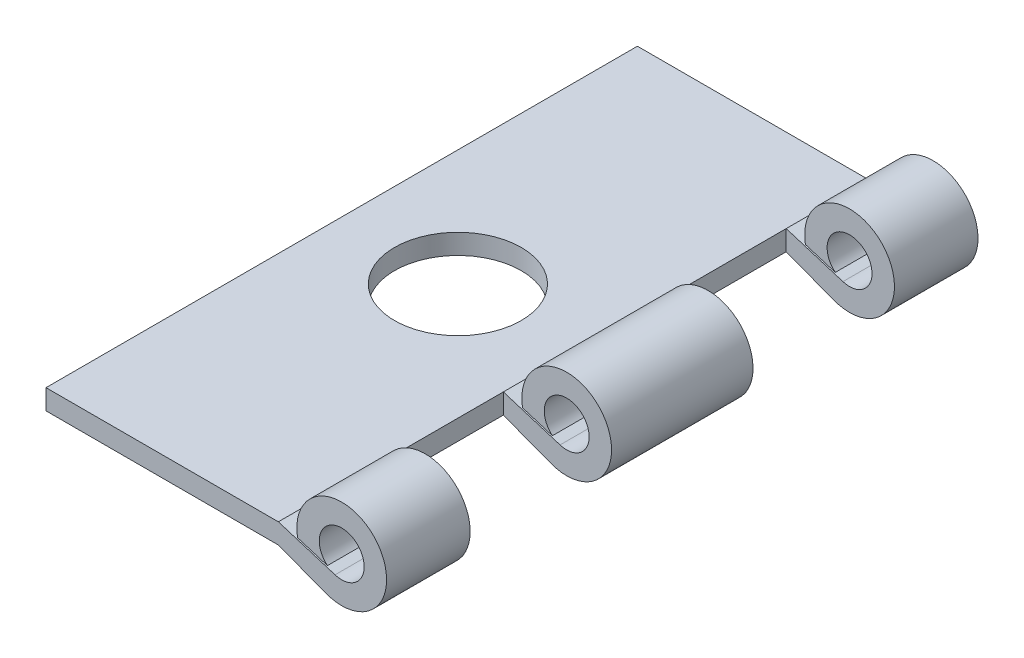
ISO-10303-21;
HEADER;
FILE_DESCRIPTION(('STEP AP214'),'2;1');
FILE_NAME('part.step','',(''),(''),'','','');
FILE_SCHEMA(('AUTOMOTIVE_DESIGN { 1 0 10303 214 1 1 1 1 }'));
ENDSEC;
DATA;
#1=APPLICATION_CONTEXT('core data for automotive mechanical design processes');
#2=APPLICATION_PROTOCOL_DEFINITION('international standard','automotive_design',2000,#1);
#3=PRODUCT_CONTEXT('',#1,'mechanical');
#4=PRODUCT('Part','Part','',(#3));
#5=PRODUCT_RELATED_PRODUCT_CATEGORY('part','',(#4));
#6=PRODUCT_DEFINITION_FORMATION('','',#4);
#7=PRODUCT_DEFINITION_CONTEXT('part definition',#1,'design');
#8=PRODUCT_DEFINITION('design','',#6,#7);
#9=PRODUCT_DEFINITION_SHAPE('','',#8);
#10=(LENGTH_UNIT() NAMED_UNIT(*) SI_UNIT(.MILLI.,.METRE.));
#11=(NAMED_UNIT(*) PLANE_ANGLE_UNIT() SI_UNIT($,.RADIAN.));
#12=(NAMED_UNIT(*) SI_UNIT($,.STERADIAN.) SOLID_ANGLE_UNIT());
#13=UNCERTAINTY_MEASURE_WITH_UNIT(LENGTH_MEASURE(1.E-05),#10,'distance_accuracy_value','');
#14=(GEOMETRIC_REPRESENTATION_CONTEXT(3) GLOBAL_UNCERTAINTY_ASSIGNED_CONTEXT((#13)) GLOBAL_UNIT_ASSIGNED_CONTEXT((#10,
#11,#12)) REPRESENTATION_CONTEXT('',''));
#15=CARTESIAN_POINT('',(0.,0.,0.));
#16=DIRECTION('',(0.,0.,1.));
#17=DIRECTION('',(1.,0.,0.));
#18=AXIS2_PLACEMENT_3D('',#15,#16,#17);
#19=CARTESIAN_POINT('',(18.8515625,0.,88.9));
#20=DIRECTION('',(0.,0.,-1.));
#21=DIRECTION('',(-1.,0.,0.));
#22=AXIS2_PLACEMENT_3D('',#19,#20,#21);
#23=CYLINDRICAL_SURFACE('',#22,6.746875);
#24=CARTESIAN_POINT('',(18.8515625,0.,55.0798999999995));
#25=DIRECTION('',(0.,0.,-1.));
#26=DIRECTION('',(-1.,0.,0.));
#27=AXIS2_PLACEMENT_3D('',#24,#25,#26);
#28=CIRCLE('',#27,6.746875);
#29=CARTESIAN_POINT('',(12.214407068558,-1.21181271016004,55.0798999999996));
#30=VERTEX_POINT('',#29);
#31=CARTESIAN_POINT('',(16.4616953830601,-6.3094260776234,55.0798999999995));
#32=VERTEX_POINT('',#31);
#33=EDGE_CURVE('E359',#30,#32,#28,.T.);
#34=ORIENTED_EDGE('',*,*,#33,.T.);
#35=DIRECTION('',(0.,0.,-1.));
#36=VECTOR('',#35,1.);
#37=CARTESIAN_POINT('',(16.4616953830601,-6.3094260776234,88.9));
#38=LINE('',#37,#36);
#39=CARTESIAN_POINT('',(16.4616953830601,-6.3094260776234,33.8200999999996));
#40=VERTEX_POINT('',#39);
#41=EDGE_CURVE('E255',#32,#40,#38,.T.);
#42=ORIENTED_EDGE('',*,*,#41,.T.);
#43=CARTESIAN_POINT('',(18.8515625,0.,33.8200999999995));
#44=DIRECTION('',(0.,0.,1.));
#45=DIRECTION('',(1.,0.,0.));
#46=AXIS2_PLACEMENT_3D('',#43,#44,#45);
#47=CIRCLE('',#46,6.746875);
#48=CARTESIAN_POINT('',(12.214407068558,-1.21181271016004,33.8200999999996));
#49=VERTEX_POINT('',#48);
#50=EDGE_CURVE('E55',#40,#49,#47,.T.);
#51=ORIENTED_EDGE('',*,*,#50,.T.);
#52=DIRECTION('',(0.,0.,-1.));
#53=VECTOR('',#52,1.);
#54=CARTESIAN_POINT('',(12.214407068558,-1.21181271016004,88.9));
#55=LINE('',#54,#53);
#56=EDGE_CURVE('E239',#30,#49,#55,.T.);
#57=ORIENTED_EDGE('',*,*,#56,.F.);
#58=EDGE_LOOP('',(#34,#42,#51,#57));
#59=FACE_BOUND('',#58,.T.);
#60=ADVANCED_FACE('F40',(#59),#23,.T.);
#61=CARTESIAN_POINT('',(18.8515625,0.,12.5602999999995));
#62=DIRECTION('',(0.,0.,-1.));
#63=DIRECTION('',(-1.,0.,0.));
#64=AXIS2_PLACEMENT_3D('',#61,#62,#63);
#65=CIRCLE('',#64,6.746875);
#66=CARTESIAN_POINT('',(12.214407068558,-1.21181271016004,12.5602999999996));
#67=VERTEX_POINT('',#66);
#68=CARTESIAN_POINT('',(16.4616953830601,-6.3094260776234,12.5602999999995));
#69=VERTEX_POINT('',#68);
#70=EDGE_CURVE('E337',#67,#69,#65,.T.);
#71=ORIENTED_EDGE('',*,*,#70,.T.);
#72=CARTESIAN_POINT('',(16.4616953830601,-6.3094260776234,0.));
#73=VERTEX_POINT('',#72);
#74=EDGE_CURVE('E256',#69,#73,#38,.T.);
#75=ORIENTED_EDGE('',*,*,#74,.T.);
#76=CARTESIAN_POINT('',(18.8515625,0.,0.));
#77=DIRECTION('',(0.,0.,1.));
#78=DIRECTION('',(1.,0.,0.));
#79=AXIS2_PLACEMENT_3D('',#76,#77,#78);
#80=CIRCLE('',#79,6.746875);
#81=CARTESIAN_POINT('',(12.214407068558,-1.21181271016004,0.));
#82=VERTEX_POINT('',#81);
#83=EDGE_CURVE('E269',#73,#82,#80,.T.);
#84=ORIENTED_EDGE('',*,*,#83,.T.);
#85=EDGE_CURVE('E236',#67,#82,#55,.T.);
#86=ORIENTED_EDGE('',*,*,#85,.F.);
#87=EDGE_LOOP('',(#71,#75,#84,#86));
#88=FACE_BOUND('',#87,.T.);
#89=ADVANCED_FACE('F396',(#88),#23,.T.);
#90=CARTESIAN_POINT('',(12.214407068558,-1.21181271016004,88.9));
#91=DIRECTION('',(0.295573710543315,0.955319936793772,0.));
#92=DIRECTION('',(-0.955319936793772,0.295573710543315,0.));
#93=AXIS2_PLACEMENT_3D('',#90,#91,#92);
#94=PLANE('',#93);
#95=DIRECTION('',(0.,0.,-1.));
#96=VECTOR('',#95,1.);
#97=CARTESIAN_POINT('',(16.7027092545924,-2.60048270444304,88.9));
#98=LINE('',#97,#96);
#99=CARTESIAN_POINT('',(16.7027092545924,-2.60048270444304,55.0798999999995));
#100=VERTEX_POINT('',#99);
#101=CARTESIAN_POINT('',(16.7027092545924,-2.60048270444304,33.8200999999995));
#102=VERTEX_POINT('',#101);
#103=EDGE_CURVE('E237',#100,#102,#98,.T.);
#104=ORIENTED_EDGE('',*,*,#103,.F.);
#105=DIRECTION('',(-0.955319936793772,0.295573710543315,0.));
#106=VECTOR('',#105,1.);
#107=CARTESIAN_POINT('',(12.2144070685577,-1.21181271015994,55.0798999999996));
#108=LINE('',#107,#106);
#109=EDGE_CURVE('E361',#100,#30,#108,.T.);
#110=ORIENTED_EDGE('',*,*,#109,.T.);
#111=ORIENTED_EDGE('',*,*,#56,.T.);
#112=DIRECTION('',(0.955319936793772,-0.295573710543315,0.));
#113=VECTOR('',#112,1.);
#114=CARTESIAN_POINT('',(12.2144070685575,-1.21181271015987,33.8200999999996));
#115=LINE('',#114,#113);
#116=EDGE_CURVE('E323',#49,#102,#115,.T.);
#117=ORIENTED_EDGE('',*,*,#116,.T.);
#118=EDGE_LOOP('',(#104,#110,#111,#117));
#119=FACE_BOUND('',#118,.T.);
#120=ADVANCED_FACE('F386',(#119),#94,.F.);
#121=CARTESIAN_POINT('',(16.7027092545924,-2.60048270444304,12.5602999999995));
#122=VERTEX_POINT('',#121);
#123=CARTESIAN_POINT('',(16.7027092545924,-2.60048270444304,0.));
#124=VERTEX_POINT('',#123);
#125=EDGE_CURVE('E231',#122,#124,#98,.T.);
#126=ORIENTED_EDGE('',*,*,#125,.F.);
#127=DIRECTION('',(-0.955319936793772,0.295573710543315,0.));
#128=VECTOR('',#127,1.);
#129=CARTESIAN_POINT('',(12.2144070685573,-1.21181271015982,12.5602999999996));
#130=LINE('',#129,#128);
#131=EDGE_CURVE('E339',#122,#67,#130,.T.);
#132=ORIENTED_EDGE('',*,*,#131,.T.);
#133=ORIENTED_EDGE('',*,*,#85,.T.);
#134=DIRECTION('',(0.955319936793772,-0.295573710543315,0.));
#135=VECTOR('',#134,1.);
#136=CARTESIAN_POINT('',(12.214407068558,-1.21181271016004,0.));
#137=LINE('',#136,#135);
#138=EDGE_CURVE('E271',#82,#124,#137,.T.);
#139=ORIENTED_EDGE('',*,*,#138,.T.);
#140=EDGE_LOOP('',(#126,#132,#133,#139));
#141=FACE_BOUND('',#140,.T.);
#142=ADVANCED_FACE('F387',(#141),#94,.F.);
#143=CARTESIAN_POINT('',(18.8515625,0.,88.9));
#144=DIRECTION('',(0.,0.,-1.));
#145=DIRECTION('',(-1.,0.,0.));
#146=AXIS2_PLACEMENT_3D('',#143,#144,#145);
#147=CYLINDRICAL_SURFACE('',#146,3.3734375);
#148=DIRECTION('',(0.,0.,-1.));
#149=VECTOR('',#148,1.);
#150=CARTESIAN_POINT('',(17.854463060839,-3.22271209927774,88.9));
#151=LINE('',#150,#149);
#152=CARTESIAN_POINT('',(17.854463060839,-3.22271209927774,55.0798999999995));
#153=VERTEX_POINT('',#152);
#154=CARTESIAN_POINT('',(17.854463060839,-3.22271209927774,33.8200999999995));
#155=VERTEX_POINT('',#154);
#156=EDGE_CURVE('E232',#153,#155,#151,.T.);
#157=ORIENTED_EDGE('',*,*,#156,.F.);
#158=CARTESIAN_POINT('',(18.8515625,0.,55.0798999999995));
#159=DIRECTION('',(0.,0.,-1.));
#160=DIRECTION('',(-1.,0.,0.));
#161=AXIS2_PLACEMENT_3D('',#158,#159,#160);
#162=CIRCLE('',#161,3.3734375);
#163=EDGE_CURVE('E364',#153,#100,#162,.F.);
#164=ORIENTED_EDGE('',*,*,#163,.T.);
#165=ORIENTED_EDGE('',*,*,#103,.T.);
#166=CARTESIAN_POINT('',(18.8515625,0.,33.8200999999995));
#167=DIRECTION('',(0.,0.,1.));
#168=DIRECTION('',(1.,0.,0.));
#169=AXIS2_PLACEMENT_3D('',#166,#167,#168);
#170=CIRCLE('',#169,3.3734375);
#171=EDGE_CURVE('E332',#102,#155,#170,.F.);
#172=ORIENTED_EDGE('',*,*,#171,.T.);
#173=EDGE_LOOP('',(#157,#164,#165,#172));
#174=FACE_BOUND('',#173,.T.);
#175=ADVANCED_FACE('F393',(#174),#147,.F.);
#176=CARTESIAN_POINT('',(17.854463060839,-3.22271209927774,12.5602999999995));
#177=VERTEX_POINT('',#176);
#178=CARTESIAN_POINT('',(17.854463060839,-3.22271209927774,0.));
#179=VERTEX_POINT('',#178);
#180=EDGE_CURVE('E226',#177,#179,#151,.T.);
#181=ORIENTED_EDGE('',*,*,#180,.F.);
#182=CARTESIAN_POINT('',(18.8515625,0.,12.5602999999995));
#183=DIRECTION('',(0.,0.,-1.));
#184=DIRECTION('',(-1.,0.,0.));
#185=AXIS2_PLACEMENT_3D('',#182,#183,#184);
#186=CIRCLE('',#185,3.3734375);
#187=EDGE_CURVE('E342',#177,#122,#186,.F.);
#188=ORIENTED_EDGE('',*,*,#187,.T.);
#189=ORIENTED_EDGE('',*,*,#125,.T.);
#190=CARTESIAN_POINT('',(18.8515625,0.,0.));
#191=DIRECTION('',(0.,0.,-1.));
#192=DIRECTION('',(1.,0.,0.));
#193=AXIS2_PLACEMENT_3D('',#190,#191,#192);
#194=CIRCLE('',#193,3.3734375);
#195=EDGE_CURVE('E275',#124,#179,#194,.T.);
#196=ORIENTED_EDGE('',*,*,#195,.T.);
#197=EDGE_LOOP('',(#181,#188,#189,#196));
#198=FACE_BOUND('',#197,.T.);
#199=ADVANCED_FACE('F394',(#198),#147,.F.);
#200=CARTESIAN_POINT('',(9.32656249999999,-0.5842,88.9));
#201=DIRECTION('',(-0.295573710543315,-0.955319936793772,0.));
#202=DIRECTION('',(0.955319936793772,-0.295573710543315,0.));
#203=AXIS2_PLACEMENT_3D('',#200,#201,#202);
#204=PLANE('',#203);
#205=DIRECTION('',(0.,0.,-1.));
#206=VECTOR('',#205,1.);
#207=CARTESIAN_POINT('',(9.32656249999999,-0.5842,88.9));
#208=LINE('',#207,#206);
#209=CARTESIAN_POINT('',(9.3265625000001,-0.5842,55.0798999999996));
#210=VERTEX_POINT('',#209);
#211=CARTESIAN_POINT('',(9.32656249999985,-0.5842,33.8200999999996));
#212=VERTEX_POINT('',#211);
#213=EDGE_CURVE('E227',#210,#212,#208,.T.);
#214=ORIENTED_EDGE('',*,*,#213,.F.);
#215=DIRECTION('',(0.955319936793772,-0.295573710543315,0.));
#216=VECTOR('',#215,1.);
#217=CARTESIAN_POINT('',(9.32656249999968,-0.584199999999902,55.0798999999996));
#218=LINE('',#217,#216);
#219=EDGE_CURVE('E321',#210,#153,#218,.T.);
#220=ORIENTED_EDGE('',*,*,#219,.T.);
#221=ORIENTED_EDGE('',*,*,#156,.T.);
#222=DIRECTION('',(-0.955319936793772,0.295573710543315,0.));
#223=VECTOR('',#222,1.);
#224=CARTESIAN_POINT('',(9.32656249999946,-0.584199999999834,33.8200999999996));
#225=LINE('',#224,#223);
#226=EDGE_CURVE('E335',#155,#212,#225,.T.);
#227=ORIENTED_EDGE('',*,*,#226,.T.);
#228=EDGE_LOOP('',(#214,#220,#221,#227));
#229=FACE_BOUND('',#228,.T.);
#230=ADVANCED_FACE('F424',(#229),#204,.F.);
#231=CARTESIAN_POINT('',(9.32656249999964,-0.5842,12.5602999999996));
#232=VERTEX_POINT('',#231);
#233=CARTESIAN_POINT('',(9.32656249999999,-0.5842,0.));
#234=VERTEX_POINT('',#233);
#235=EDGE_CURVE('E222',#232,#234,#208,.T.);
#236=ORIENTED_EDGE('',*,*,#235,.F.);
#237=DIRECTION('',(0.955319936793772,-0.295573710543315,0.));
#238=VECTOR('',#237,1.);
#239=CARTESIAN_POINT('',(9.32656249999928,-0.584199999999779,12.5602999999996));
#240=LINE('',#239,#238);
#241=EDGE_CURVE('E345',#232,#177,#240,.T.);
#242=ORIENTED_EDGE('',*,*,#241,.T.);
#243=ORIENTED_EDGE('',*,*,#180,.T.);
#244=DIRECTION('',(-0.955319936793772,0.295573710543315,0.));
#245=VECTOR('',#244,1.);
#246=CARTESIAN_POINT('',(9.32656249999999,-0.5842,0.));
#247=LINE('',#246,#245);
#248=EDGE_CURVE('E278',#179,#234,#247,.T.);
#249=ORIENTED_EDGE('',*,*,#248,.T.);
#250=EDGE_LOOP('',(#236,#242,#243,#249));
#251=FACE_BOUND('',#250,.T.);
#252=ADVANCED_FACE('F423',(#251),#204,.F.);
#253=CARTESIAN_POINT('',(9.3265625,-3.6068,88.9));
#254=DIRECTION('',(0.354218377684474,0.935162734988183,0.));
#255=DIRECTION('',(-0.935162734988183,0.354218377684474,0.));
#256=AXIS2_PLACEMENT_3D('',#253,#254,#255);
#257=PLANE('',#256);
#258=ORIENTED_EDGE('',*,*,#41,.F.);
#259=DIRECTION('',(-0.935162734988183,0.354218377684474,0.));
#260=VECTOR('',#259,1.);
#261=CARTESIAN_POINT('',(9.3265624999997,-3.60679999999989,55.0798999999996));
#262=LINE('',#261,#260);
#263=CARTESIAN_POINT('',(9.3265625000001,-3.60680000000004,55.0798999999996));
#264=VERTEX_POINT('',#263);
#265=EDGE_CURVE('E11',#32,#264,#262,.T.);
#266=ORIENTED_EDGE('',*,*,#265,.T.);
#267=DIRECTION('',(0.,0.,-1.));
#268=VECTOR('',#267,1.);
#269=CARTESIAN_POINT('',(9.3265625,-3.6068,88.9));
#270=LINE('',#269,#268);
#271=CARTESIAN_POINT('',(9.32656249999985,-3.60679999999995,33.8200999999996));
#272=VERTEX_POINT('',#271);
#273=EDGE_CURVE('E204',#264,#272,#270,.T.);
#274=ORIENTED_EDGE('',*,*,#273,.T.);
#275=DIRECTION('',(0.935162734988183,-0.354218377684474,0.));
#276=VECTOR('',#275,1.);
#277=CARTESIAN_POINT('',(9.32656249999949,-3.60679999999981,33.8200999999996));
#278=LINE('',#277,#276);
#279=EDGE_CURVE('E175',#272,#40,#278,.T.);
#280=ORIENTED_EDGE('',*,*,#279,.T.);
#281=EDGE_LOOP('',(#258,#266,#274,#280));
#282=FACE_BOUND('',#281,.T.);
#283=ADVANCED_FACE('F207',(#282),#257,.F.);
#284=ORIENTED_EDGE('',*,*,#74,.F.);
#285=DIRECTION('',(-0.935162734988183,0.354218377684474,0.));
#286=VECTOR('',#285,1.);
#287=CARTESIAN_POINT('',(9.32656249999932,-3.60679999999974,12.5602999999996));
#288=LINE('',#287,#286);
#289=CARTESIAN_POINT('',(9.32656249999964,-3.60679999999987,12.5602999999996));
#290=VERTEX_POINT('',#289);
#291=EDGE_CURVE('E184',#69,#290,#288,.T.);
#292=ORIENTED_EDGE('',*,*,#291,.T.);
#293=CARTESIAN_POINT('',(9.3265625,-3.6068,0.));
#294=VERTEX_POINT('',#293);
#295=EDGE_CURVE('E205',#290,#294,#270,.T.);
#296=ORIENTED_EDGE('',*,*,#295,.T.);
#297=DIRECTION('',(0.935162734988183,-0.354218377684474,0.));
#298=VECTOR('',#297,1.);
#299=CARTESIAN_POINT('',(9.3265625,-3.6068,0.));
#300=LINE('',#299,#298);
#301=EDGE_CURVE('E286',#294,#73,#300,.T.);
#302=ORIENTED_EDGE('',*,*,#301,.T.);
#303=EDGE_LOOP('',(#284,#292,#296,#302));
#304=FACE_BOUND('',#303,.T.);
#305=ADVANCED_FACE('F395',(#304),#257,.F.);
#306=CARTESIAN_POINT('',(18.8515625,0.,76.3396999999995));
#307=DIRECTION('',(0.,0.,1.));
#308=DIRECTION('',(1.,0.,0.));
#309=AXIS2_PLACEMENT_3D('',#306,#307,#308);
#310=CIRCLE('',#309,6.746875);
#311=CARTESIAN_POINT('',(16.4616953830601,-6.3094260776234,76.3396999999996));
#312=VERTEX_POINT('',#311);
#313=CARTESIAN_POINT('',(12.214407068558,-1.21181271016004,76.3396999999996));
#314=VERTEX_POINT('',#313);
#315=EDGE_CURVE('E63',#312,#314,#310,.T.);
#316=ORIENTED_EDGE('',*,*,#315,.T.);
#317=CARTESIAN_POINT('',(12.214407068558,-1.21181271016004,88.9));
#318=VERTEX_POINT('',#317);
#319=EDGE_CURVE('E185',#318,#314,#55,.T.);
#320=ORIENTED_EDGE('',*,*,#319,.F.);
#321=CARTESIAN_POINT('',(18.8515625,0.,88.9));
#322=DIRECTION('',(0.,0.,1.));
#323=DIRECTION('',(1.,0.,0.));
#324=AXIS2_PLACEMENT_3D('',#321,#322,#323);
#325=CIRCLE('',#324,6.746875);
#326=CARTESIAN_POINT('',(16.4616953830601,-6.3094260776234,88.9));
#327=VERTEX_POINT('',#326);
#328=EDGE_CURVE('E254',#327,#318,#325,.T.);
#329=ORIENTED_EDGE('',*,*,#328,.F.);
#330=EDGE_CURVE('E215',#327,#312,#38,.T.);
#331=ORIENTED_EDGE('',*,*,#330,.T.);
#332=EDGE_LOOP('',(#316,#320,#329,#331));
#333=FACE_BOUND('',#332,.T.);
#334=ADVANCED_FACE('F42',(#333),#23,.T.);
#335=ORIENTED_EDGE('',*,*,#319,.T.);
#336=DIRECTION('',(0.955319936793772,-0.295573710543315,0.));
#337=VECTOR('',#336,1.);
#338=CARTESIAN_POINT('',(12.2144070685579,-1.21181271016,76.3396999999996));
#339=LINE('',#338,#337);
#340=CARTESIAN_POINT('',(16.7027092545924,-2.60048270444304,76.3396999999996));
#341=VERTEX_POINT('',#340);
#342=EDGE_CURVE('E350',#314,#341,#339,.T.);
#343=ORIENTED_EDGE('',*,*,#342,.T.);
#344=CARTESIAN_POINT('',(16.7027092545924,-2.60048270444304,88.9));
#345=VERTEX_POINT('',#344);
#346=EDGE_CURVE('E233',#345,#341,#98,.T.);
#347=ORIENTED_EDGE('',*,*,#346,.F.);
#348=DIRECTION('',(0.955319936793772,-0.295573710543315,0.));
#349=VECTOR('',#348,1.);
#350=CARTESIAN_POINT('',(12.214407068558,-1.21181271016004,88.9));
#351=LINE('',#350,#349);
#352=EDGE_CURVE('E290',#318,#345,#351,.T.);
#353=ORIENTED_EDGE('',*,*,#352,.F.);
#354=EDGE_LOOP('',(#335,#343,#347,#353));
#355=FACE_BOUND('',#354,.T.);
#356=ADVANCED_FACE('F384',(#355),#94,.F.);
#357=ORIENTED_EDGE('',*,*,#346,.T.);
#358=CARTESIAN_POINT('',(18.8515625,0.,76.3396999999995));
#359=DIRECTION('',(0.,0.,1.));
#360=DIRECTION('',(1.,0.,0.));
#361=AXIS2_PLACEMENT_3D('',#358,#359,#360);
#362=CIRCLE('',#361,3.3734375);
#363=CARTESIAN_POINT('',(17.854463060839,-3.22271209927774,76.3396999999995));
#364=VERTEX_POINT('',#363);
#365=EDGE_CURVE('E353',#341,#364,#362,.F.);
#366=ORIENTED_EDGE('',*,*,#365,.T.);
#367=CARTESIAN_POINT('',(17.854463060839,-3.22271209927774,88.9));
#368=VERTEX_POINT('',#367);
#369=EDGE_CURVE('E228',#368,#364,#151,.T.);
#370=ORIENTED_EDGE('',*,*,#369,.F.);
#371=CARTESIAN_POINT('',(18.8515625,0.,88.9));
#372=DIRECTION('',(0.,0.,-1.));
#373=DIRECTION('',(1.,0.,0.));
#374=AXIS2_PLACEMENT_3D('',#371,#372,#373);
#375=CIRCLE('',#374,3.3734375);
#376=EDGE_CURVE('E292',#345,#368,#375,.T.);
#377=ORIENTED_EDGE('',*,*,#376,.F.);
#378=EDGE_LOOP('',(#357,#366,#370,#377));
#379=FACE_BOUND('',#378,.T.);
#380=ADVANCED_FACE('F381',(#379),#147,.F.);
#381=ORIENTED_EDGE('',*,*,#369,.T.);
#382=DIRECTION('',(-0.955319936793772,0.295573710543315,0.));
#383=VECTOR('',#382,1.);
#384=CARTESIAN_POINT('',(9.32656249999988,-0.584199999999964,76.3396999999996));
#385=LINE('',#384,#383);
#386=CARTESIAN_POINT('',(9.32656250000031,-0.5842,76.3396999999996));
#387=VERTEX_POINT('',#386);
#388=EDGE_CURVE('E356',#364,#387,#385,.T.);
#389=ORIENTED_EDGE('',*,*,#388,.T.);
#390=CARTESIAN_POINT('',(9.32656249999999,-0.5842,88.9));
#391=VERTEX_POINT('',#390);
#392=EDGE_CURVE('E223',#391,#387,#208,.T.);
#393=ORIENTED_EDGE('',*,*,#392,.F.);
#394=DIRECTION('',(-0.955319936793772,0.295573710543315,0.));
#395=VECTOR('',#394,1.);
#396=CARTESIAN_POINT('',(9.32656249999999,-0.5842,88.9));
#397=LINE('',#396,#395);
#398=EDGE_CURVE('E298',#368,#391,#397,.T.);
#399=ORIENTED_EDGE('',*,*,#398,.F.);
#400=EDGE_LOOP('',(#381,#389,#393,#399));
#401=FACE_BOUND('',#400,.T.);
#402=ADVANCED_FACE('F376',(#401),#204,.F.);
#403=CARTESIAN_POINT('',(-25.5984375,-0.5842,88.9));
#404=DIRECTION('',(0.,-1.,0.));
#405=DIRECTION('',(0.,0.,-1.));
#406=AXIS2_PLACEMENT_3D('',#403,#404,#405);
#407=PLANE('',#406);
#408=CARTESIAN_POINT('',(-8.13593750000001,-0.584199999999993,44.4499999999996));
#409=DIRECTION('',(0.,-1.,0.));
#410=DIRECTION('',(0.,0.,-1.));
#411=AXIS2_PLACEMENT_3D('',#408,#409,#410);
#412=CIRCLE('',#411,9.525);
#413=CARTESIAN_POINT('',(-8.13593750000001,-0.584199999999993,34.9249999999996));
#414=VERTEX_POINT('',#413);
#415=EDGE_CURVE('E196',#414,#414,#412,.T.);
#416=ORIENTED_EDGE('',*,*,#415,.T.);
#417=EDGE_LOOP('',(#416));
#418=FACE_BOUND('',#417,.T.);
#419=DIRECTION('',(-1.,0.,0.));
#420=VECTOR('',#419,1.);
#421=CARTESIAN_POINT('',(-25.5984375,-0.5842,0.));
#422=LINE('',#421,#420);
#423=CARTESIAN_POINT('',(-25.5984375,-0.5842,0.));
#424=VERTEX_POINT('',#423);
#425=EDGE_CURVE('E281',#234,#424,#422,.T.);
#426=ORIENTED_EDGE('',*,*,#425,.T.);
#427=DIRECTION('',(0.,0.,-1.));
#428=VECTOR('',#427,1.);
#429=CARTESIAN_POINT('',(-25.5984375,-0.5842,88.9));
#430=LINE('',#429,#428);
#431=CARTESIAN_POINT('',(-25.5984375,-0.5842,88.9));
#432=VERTEX_POINT('',#431);
#433=EDGE_CURVE('E219',#432,#424,#430,.T.);
#434=ORIENTED_EDGE('',*,*,#433,.F.);
#435=DIRECTION('',(-1.,0.,0.));
#436=VECTOR('',#435,1.);
#437=CARTESIAN_POINT('',(-25.5984375,-0.5842,88.9));
#438=LINE('',#437,#436);
#439=EDGE_CURVE('E300',#391,#432,#438,.T.);
#440=ORIENTED_EDGE('',*,*,#439,.F.);
#441=ORIENTED_EDGE('',*,*,#392,.T.);
#442=DIRECTION('',(0.,0.,-1.));
#443=VECTOR('',#442,1.);
#444=CARTESIAN_POINT('',(9.32656250000043,-0.5842,88.8999999999997));
#445=LINE('',#444,#443);
#446=EDGE_CURVE('E272',#387,#210,#445,.T.);
#447=ORIENTED_EDGE('',*,*,#446,.T.);
#448=ORIENTED_EDGE('',*,*,#213,.T.);
#449=DIRECTION('',(0.,0.,-1.));
#450=VECTOR('',#449,1.);
#451=CARTESIAN_POINT('',(9.32656250000039,-0.5842,88.8999999999997));
#452=LINE('',#451,#450);
#453=EDGE_CURVE('E194',#212,#232,#452,.T.);
#454=ORIENTED_EDGE('',*,*,#453,.T.);
#455=ORIENTED_EDGE('',*,*,#235,.T.);
#456=EDGE_LOOP('',(#426,#434,#440,#441,#447,#448,#454,#455));
#457=FACE_BOUND('',#456,.T.);
#458=ADVANCED_FACE('F372',(#418,#457),#407,.F.);
#459=CARTESIAN_POINT('',(-25.5984375,-0.5842,88.9));
#460=DIRECTION('',(1.,0.,0.));
#461=DIRECTION('',(0.,0.,-1.));
#462=AXIS2_PLACEMENT_3D('',#459,#460,#461);
#463=PLANE('',#462);
#464=DIRECTION('',(0.,-1.,0.));
#465=VECTOR('',#464,1.);
#466=CARTESIAN_POINT('',(-25.5984375,-0.5842,0.));
#467=LINE('',#466,#465);
#468=CARTESIAN_POINT('',(-25.5984375,-3.6068,0.));
#469=VERTEX_POINT('',#468);
#470=EDGE_CURVE('E283',#424,#469,#467,.T.);
#471=ORIENTED_EDGE('',*,*,#470,.T.);
#472=DIRECTION('',(0.,0.,-1.));
#473=VECTOR('',#472,1.);
#474=CARTESIAN_POINT('',(-25.5984375,-3.6068,88.9));
#475=LINE('',#474,#473);
#476=CARTESIAN_POINT('',(-25.5984375,-3.6068,88.9));
#477=VERTEX_POINT('',#476);
#478=EDGE_CURVE('E214',#477,#469,#475,.T.);
#479=ORIENTED_EDGE('',*,*,#478,.F.);
#480=DIRECTION('',(0.,-1.,0.));
#481=VECTOR('',#480,1.);
#482=CARTESIAN_POINT('',(-25.5984375,-0.5842,88.9));
#483=LINE('',#482,#481);
#484=EDGE_CURVE('E265',#432,#477,#483,.T.);
#485=ORIENTED_EDGE('',*,*,#484,.F.);
#486=ORIENTED_EDGE('',*,*,#433,.T.);
#487=EDGE_LOOP('',(#471,#479,#485,#486));
#488=FACE_BOUND('',#487,.T.);
#489=ADVANCED_FACE('F308',(#488),#463,.F.);
#490=CARTESIAN_POINT('',(-25.5984375,-3.6068,88.9));
#491=DIRECTION('',(0.,1.,0.));
#492=DIRECTION('',(0.,0.,1.));
#493=AXIS2_PLACEMENT_3D('',#490,#491,#492);
#494=PLANE('',#493);
#495=CARTESIAN_POINT('',(-8.13593750000001,-3.6068,44.4499999999996));
#496=DIRECTION('',(0.,-1.,0.));
#497=DIRECTION('',(0.,0.,-1.));
#498=AXIS2_PLACEMENT_3D('',#495,#496,#497);
#499=CIRCLE('',#498,9.525);
#500=CARTESIAN_POINT('',(-8.13593750000001,-3.6068,34.9249999999996));
#501=VERTEX_POINT('',#500);
#502=EDGE_CURVE('E468',#501,#501,#499,.T.);
#503=ORIENTED_EDGE('',*,*,#502,.F.);
#504=EDGE_LOOP('',(#503));
#505=FACE_BOUND('',#504,.T.);
#506=DIRECTION('',(1.,0.,0.));
#507=VECTOR('',#506,1.);
#508=CARTESIAN_POINT('',(-25.5984375,-3.6068,0.));
#509=LINE('',#508,#507);
#510=EDGE_CURVE('E285',#469,#294,#509,.T.);
#511=ORIENTED_EDGE('',*,*,#510,.T.);
#512=ORIENTED_EDGE('',*,*,#295,.F.);
#513=EDGE_CURVE('E191',#272,#290,#270,.T.);
#514=ORIENTED_EDGE('',*,*,#513,.F.);
#515=ORIENTED_EDGE('',*,*,#273,.F.);
#516=CARTESIAN_POINT('',(9.32656250000031,-3.60680000000013,76.3396999999996));
#517=VERTEX_POINT('',#516);
#518=EDGE_CURVE('E209',#517,#264,#270,.T.);
#519=ORIENTED_EDGE('',*,*,#518,.F.);
#520=CARTESIAN_POINT('',(9.3265625,-3.6068,88.9));
#521=VERTEX_POINT('',#520);
#522=EDGE_CURVE('E210',#521,#517,#270,.T.);
#523=ORIENTED_EDGE('',*,*,#522,.F.);
#524=DIRECTION('',(1.,0.,0.));
#525=VECTOR('',#524,1.);
#526=CARTESIAN_POINT('',(-25.5984375,-3.6068,88.9));
#527=LINE('',#526,#525);
#528=EDGE_CURVE('E262',#477,#521,#527,.T.);
#529=ORIENTED_EDGE('',*,*,#528,.F.);
#530=ORIENTED_EDGE('',*,*,#478,.T.);
#531=EDGE_LOOP('',(#511,#512,#514,#515,#519,#523,#529,#530));
#532=FACE_BOUND('',#531,.T.);
#533=ADVANCED_FACE('F202',(#505,#532),#494,.F.);
#534=ORIENTED_EDGE('',*,*,#522,.T.);
#535=DIRECTION('',(0.935162734988183,-0.354218377684474,0.));
#536=VECTOR('',#535,1.);
#537=CARTESIAN_POINT('',(9.32656249999989,-3.60679999999996,76.3396999999996));
#538=LINE('',#537,#536);
#539=EDGE_CURVE('E48',#517,#312,#538,.T.);
#540=ORIENTED_EDGE('',*,*,#539,.T.);
#541=ORIENTED_EDGE('',*,*,#330,.F.);
#542=DIRECTION('',(0.935162734988183,-0.354218377684474,0.));
#543=VECTOR('',#542,1.);
#544=CARTESIAN_POINT('',(9.3265625,-3.6068,88.9));
#545=LINE('',#544,#543);
#546=EDGE_CURVE('E257',#521,#327,#545,.T.);
#547=ORIENTED_EDGE('',*,*,#546,.F.);
#548=EDGE_LOOP('',(#534,#540,#541,#547));
#549=FACE_BOUND('',#548,.T.);
#550=ADVANCED_FACE('F245',(#549),#257,.F.);
#551=CARTESIAN_POINT('',(18.8515625,0.,88.9));
#552=DIRECTION('',(0.,0.,1.));
#553=DIRECTION('',(1.,0.,0.));
#554=AXIS2_PLACEMENT_3D('',#551,#552,#553);
#555=PLANE('',#554);
#556=ORIENTED_EDGE('',*,*,#328,.T.);
#557=ORIENTED_EDGE('',*,*,#352,.T.);
#558=ORIENTED_EDGE('',*,*,#376,.T.);
#559=ORIENTED_EDGE('',*,*,#398,.T.);
#560=ORIENTED_EDGE('',*,*,#439,.T.);
#561=ORIENTED_EDGE('',*,*,#484,.T.);
#562=ORIENTED_EDGE('',*,*,#528,.T.);
#563=ORIENTED_EDGE('',*,*,#546,.T.);
#564=EDGE_LOOP('',(#556,#557,#558,#559,#560,#561,#562,#563));
#565=FACE_BOUND('',#564,.T.);
#566=ADVANCED_FACE('F303',(#565),#555,.T.);
#567=CARTESIAN_POINT('',(18.8515625,0.,0.));
#568=DIRECTION('',(0.,0.,1.));
#569=DIRECTION('',(1.,0.,0.));
#570=AXIS2_PLACEMENT_3D('',#567,#568,#569);
#571=PLANE('',#570);
#572=ORIENTED_EDGE('',*,*,#83,.F.);
#573=ORIENTED_EDGE('',*,*,#301,.F.);
#574=ORIENTED_EDGE('',*,*,#510,.F.);
#575=ORIENTED_EDGE('',*,*,#470,.F.);
#576=ORIENTED_EDGE('',*,*,#425,.F.);
#577=ORIENTED_EDGE('',*,*,#248,.F.);
#578=ORIENTED_EDGE('',*,*,#195,.F.);
#579=ORIENTED_EDGE('',*,*,#138,.F.);
#580=EDGE_LOOP('',(#572,#573,#574,#575,#576,#577,#578,#579));
#581=FACE_BOUND('',#580,.T.);
#582=ADVANCED_FACE('F419',(#581),#571,.F.);
#583=CARTESIAN_POINT('',(9.32656249999985,-45.0342,33.8200999999996));
#584=DIRECTION('',(-1.,0.,0.));
#585=DIRECTION('',(0.,0.,1.));
#586=AXIS2_PLACEMENT_3D('',#583,#584,#585);
#587=PLANE('',#586);
#588=DIRECTION('',(0.,1.,0.));
#589=VECTOR('',#588,1.);
#590=CARTESIAN_POINT('',(9.32656249999985,-45.0342,33.8200999999996));
#591=LINE('',#590,#589);
#592=EDGE_CURVE('E178',#272,#212,#591,.T.);
#593=ORIENTED_EDGE('',*,*,#592,.F.);
#594=ORIENTED_EDGE('',*,*,#513,.T.);
#595=DIRECTION('',(0.,1.,0.));
#596=VECTOR('',#595,1.);
#597=CARTESIAN_POINT('',(9.32656249999964,-45.0342,12.5602999999996));
#598=LINE('',#597,#596);
#599=EDGE_CURVE('E195',#290,#232,#598,.T.);
#600=ORIENTED_EDGE('',*,*,#599,.T.);
#601=ORIENTED_EDGE('',*,*,#453,.F.);
#602=EDGE_LOOP('',(#593,#594,#600,#601));
#603=FACE_BOUND('',#602,.T.);
#604=ADVANCED_FACE('F189',(#603),#587,.F.);
#605=CARTESIAN_POINT('',(9.32656249999964,-45.0342,12.5602999999996));
#606=DIRECTION('',(0.,0.,-1.));
#607=DIRECTION('',(-1.,0.,0.));
#608=AXIS2_PLACEMENT_3D('',#605,#606,#607);
#609=PLANE('',#608);
#610=ORIENTED_EDGE('',*,*,#599,.F.);
#611=ORIENTED_EDGE('',*,*,#291,.F.);
#612=ORIENTED_EDGE('',*,*,#70,.F.);
#613=ORIENTED_EDGE('',*,*,#131,.F.);
#614=ORIENTED_EDGE('',*,*,#187,.F.);
#615=ORIENTED_EDGE('',*,*,#241,.F.);
#616=EDGE_LOOP('',(#610,#611,#612,#613,#614,#615));
#617=FACE_BOUND('',#616,.T.);
#618=ADVANCED_FACE('F448',(#617),#609,.F.);
#619=CARTESIAN_POINT('',(25.5984374999999,-45.0342,33.8200999999994));
#620=DIRECTION('',(0.,0.,1.));
#621=DIRECTION('',(1.,0.,0.));
#622=AXIS2_PLACEMENT_3D('',#619,#620,#621);
#623=PLANE('',#622);
#624=ORIENTED_EDGE('',*,*,#171,.F.);
#625=ORIENTED_EDGE('',*,*,#116,.F.);
#626=ORIENTED_EDGE('',*,*,#50,.F.);
#627=ORIENTED_EDGE('',*,*,#279,.F.);
#628=ORIENTED_EDGE('',*,*,#592,.T.);
#629=ORIENTED_EDGE('',*,*,#226,.F.);
#630=EDGE_LOOP('',(#624,#625,#626,#627,#628,#629));
#631=FACE_BOUND('',#630,.T.);
#632=ADVANCED_FACE('F177',(#631),#623,.F.);
#633=CARTESIAN_POINT('',(9.3265625000001,-45.0342,55.0798999999996));
#634=DIRECTION('',(-1.,0.,0.));
#635=DIRECTION('',(0.,0.,1.));
#636=AXIS2_PLACEMENT_3D('',#633,#634,#635);
#637=PLANE('',#636);
#638=DIRECTION('',(0.,1.,0.));
#639=VECTOR('',#638,1.);
#640=CARTESIAN_POINT('',(9.32656250000031,-45.0342,76.3396999999996));
#641=LINE('',#640,#639);
#642=EDGE_CURVE('E317',#517,#387,#641,.T.);
#643=ORIENTED_EDGE('',*,*,#642,.F.);
#644=ORIENTED_EDGE('',*,*,#518,.T.);
#645=DIRECTION('',(0.,1.,0.));
#646=VECTOR('',#645,1.);
#647=CARTESIAN_POINT('',(9.3265625000001,-45.0342,55.0798999999996));
#648=LINE('',#647,#646);
#649=EDGE_CURVE('E315',#264,#210,#648,.T.);
#650=ORIENTED_EDGE('',*,*,#649,.T.);
#651=ORIENTED_EDGE('',*,*,#446,.F.);
#652=EDGE_LOOP('',(#643,#644,#650,#651));
#653=FACE_BOUND('',#652,.T.);
#654=ADVANCED_FACE('F314',(#653),#637,.F.);
#655=CARTESIAN_POINT('',(25.5984375000001,-45.0342,55.0798999999995));
#656=DIRECTION('',(0.,0.,-1.));
#657=DIRECTION('',(-1.,0.,0.));
#658=AXIS2_PLACEMENT_3D('',#655,#656,#657);
#659=PLANE('',#658);
#660=ORIENTED_EDGE('',*,*,#649,.F.);
#661=ORIENTED_EDGE('',*,*,#265,.F.);
#662=ORIENTED_EDGE('',*,*,#33,.F.);
#663=ORIENTED_EDGE('',*,*,#109,.F.);
#664=ORIENTED_EDGE('',*,*,#163,.F.);
#665=ORIENTED_EDGE('',*,*,#219,.F.);
#666=EDGE_LOOP('',(#660,#661,#662,#663,#664,#665));
#667=FACE_BOUND('',#666,.T.);
#668=ADVANCED_FACE('F319',(#667),#659,.F.);
#669=CARTESIAN_POINT('',(9.32656250000031,-45.0342,76.3396999999996));
#670=DIRECTION('',(0.,0.,1.));
#671=DIRECTION('',(1.,0.,0.));
#672=AXIS2_PLACEMENT_3D('',#669,#670,#671);
#673=PLANE('',#672);
#674=ORIENTED_EDGE('',*,*,#365,.F.);
#675=ORIENTED_EDGE('',*,*,#342,.F.);
#676=ORIENTED_EDGE('',*,*,#315,.F.);
#677=ORIENTED_EDGE('',*,*,#539,.F.);
#678=ORIENTED_EDGE('',*,*,#642,.T.);
#679=ORIENTED_EDGE('',*,*,#388,.F.);
#680=EDGE_LOOP('',(#674,#675,#676,#677,#678,#679));
#681=FACE_BOUND('',#680,.T.);
#682=ADVANCED_FACE('F374',(#681),#673,.F.);
#683=CARTESIAN_POINT('',(-8.13593750000001,85.2932,44.4499999999996));
#684=DIRECTION('',(0.,-1.,0.));
#685=DIRECTION('',(0.,0.,-1.));
#686=AXIS2_PLACEMENT_3D('',#683,#684,#685);
#687=CYLINDRICAL_SURFACE('',#686,9.525);
#688=ORIENTED_EDGE('',*,*,#502,.T.);
#689=EDGE_LOOP('',(#688));
#690=FACE_BOUND('',#689,.T.);
#691=ORIENTED_EDGE('',*,*,#415,.F.);
#692=EDGE_LOOP('',(#691));
#693=FACE_BOUND('',#692,.T.);
#694=ADVANCED_FACE('F458',(#690,#693),#687,.F.);
#695=CLOSED_SHELL('',(#60,#89,#120,#142,#175,#199,#230,#252,#283,#305,#334,#356,#380,#402,#458,
#489,#533,#550,#566,#582,#604,#618,#632,#654,#668,#682,#694));
#696=MANIFOLD_SOLID_BREP('B2',#695);
#697=ADVANCED_BREP_SHAPE_REPRESENTATION('',(#18,#696),#14);
#698=SHAPE_DEFINITION_REPRESENTATION(#9,#697);
ENDSEC;
END-ISO-10303-21;
